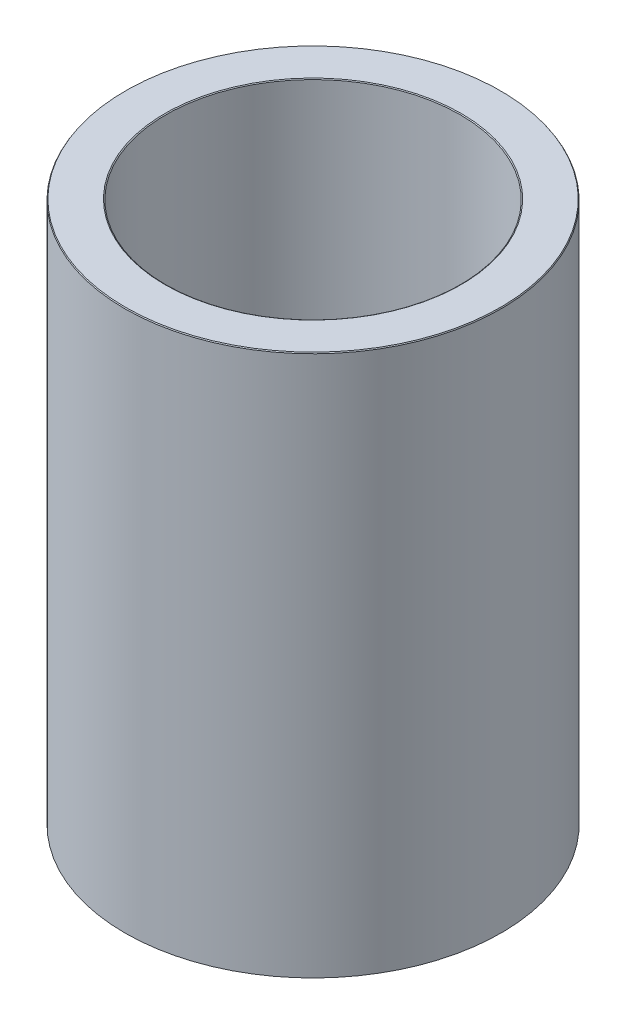
ISO-10303-21;
HEADER;
FILE_DESCRIPTION(('STEP AP214'),'2;1');
FILE_NAME('part.step','',(''),(''),'','','');
FILE_SCHEMA(('AUTOMOTIVE_DESIGN { 1 0 10303 214 1 1 1 1 }'));
ENDSEC;
DATA;
#1=APPLICATION_CONTEXT('core data for automotive mechanical design processes');
#2=APPLICATION_PROTOCOL_DEFINITION('international standard','automotive_design',2000,#1);
#3=PRODUCT_CONTEXT('',#1,'mechanical');
#4=PRODUCT('Part','Part','',(#3));
#5=PRODUCT_RELATED_PRODUCT_CATEGORY('part','',(#4));
#6=PRODUCT_DEFINITION_FORMATION('','',#4);
#7=PRODUCT_DEFINITION_CONTEXT('part definition',#1,'design');
#8=PRODUCT_DEFINITION('design','',#6,#7);
#9=PRODUCT_DEFINITION_SHAPE('','',#8);
#10=(LENGTH_UNIT() NAMED_UNIT(*) SI_UNIT(.MILLI.,.METRE.));
#11=(NAMED_UNIT(*) PLANE_ANGLE_UNIT() SI_UNIT($,.RADIAN.));
#12=(NAMED_UNIT(*) SI_UNIT($,.STERADIAN.) SOLID_ANGLE_UNIT());
#13=UNCERTAINTY_MEASURE_WITH_UNIT(LENGTH_MEASURE(1.E-05),#10,'distance_accuracy_value','');
#14=(GEOMETRIC_REPRESENTATION_CONTEXT(3) GLOBAL_UNCERTAINTY_ASSIGNED_CONTEXT((#13)) GLOBAL_UNIT_ASSIGNED_CONTEXT((#10,
#11,#12)) REPRESENTATION_CONTEXT('',''));
#15=CARTESIAN_POINT('',(0.,0.,0.));
#16=DIRECTION('',(0.,0.,1.));
#17=DIRECTION('',(1.,0.,0.));
#18=AXIS2_PLACEMENT_3D('',#15,#16,#17);
#19=CARTESIAN_POINT('',(0.,158.491382979003,0.));
#20=DIRECTION('',(0.,-1.,0.));
#21=DIRECTION('',(0.,0.,-1.));
#22=AXIS2_PLACEMENT_3D('',#19,#20,#21);
#23=CYLINDRICAL_SURFACE('',#22,55.);
#24=CARTESIAN_POINT('',(0.,0.184009060716139,0.));
#25=DIRECTION('',(0.,1.,0.));
#26=DIRECTION('',(0.,0.,1.));
#27=AXIS2_PLACEMENT_3D('',#24,#25,#26);
#28=CIRCLE('',#27,55.);
#29=CARTESIAN_POINT('',(0.,0.184009060716139,55.));
#30=VERTEX_POINT('',#29);
#31=EDGE_CURVE('E10',#30,#30,#28,.T.);
#32=ORIENTED_EDGE('',*,*,#31,.T.);
#33=EDGE_LOOP('',(#32));
#34=FACE_BOUND('',#33,.T.);
#35=CARTESIAN_POINT('',(0.,158.206325773304,0.));
#36=DIRECTION('',(0.,1.,0.));
#37=DIRECTION('',(0.,0.,1.));
#38=AXIS2_PLACEMENT_3D('',#35,#36,#37);
#39=CIRCLE('',#38,55.);
#40=CARTESIAN_POINT('',(0.,158.206325773304,55.));
#41=VERTEX_POINT('',#40);
#42=EDGE_CURVE('E50',#41,#41,#39,.F.);
#43=ORIENTED_EDGE('',*,*,#42,.T.);
#44=EDGE_LOOP('',(#43));
#45=FACE_BOUND('',#44,.T.);
#46=ADVANCED_FACE('F39',(#34,#45),#23,.T.);
#47=CARTESIAN_POINT('',(0.,158.491382979003,0.));
#48=DIRECTION('',(0.,1.,0.));
#49=DIRECTION('',(0.,0.,1.));
#50=AXIS2_PLACEMENT_3D('',#47,#48,#49);
#51=PLANE('',#50);
#52=CARTESIAN_POINT('',(0.,158.491382979003,0.));
#53=DIRECTION('',(0.,1.,0.));
#54=DIRECTION('',(0.,0.,1.));
#55=AXIS2_PLACEMENT_3D('',#52,#53,#54);
#56=CIRCLE('',#55,43.3261902332443);
#57=CARTESIAN_POINT('',(0.,158.491382979003,43.3261902332443));
#58=VERTEX_POINT('',#57);
#59=EDGE_CURVE('E58',#58,#58,#56,.F.);
#60=ORIENTED_EDGE('',*,*,#59,.T.);
#61=EDGE_LOOP('',(#60));
#62=FACE_BOUND('',#61,.T.);
#63=CARTESIAN_POINT('',(0.,158.491382979003,0.));
#64=DIRECTION('',(0.,1.,0.));
#65=DIRECTION('',(0.,0.,1.));
#66=AXIS2_PLACEMENT_3D('',#63,#64,#65);
#67=CIRCLE('',#66,54.8159909392839);
#68=CARTESIAN_POINT('',(0.,158.491382979003,54.8159909392839));
#69=VERTEX_POINT('',#68);
#70=EDGE_CURVE('E61',#69,#69,#67,.T.);
#71=ORIENTED_EDGE('',*,*,#70,.T.);
#72=EDGE_LOOP('',(#71));
#73=FACE_BOUND('',#72,.T.);
#74=ADVANCED_FACE('F88',(#62,#73),#51,.T.);
#75=CARTESIAN_POINT('',(0.,0.,0.));
#76=DIRECTION('',(0.,1.,0.));
#77=DIRECTION('',(0.,0.,1.));
#78=AXIS2_PLACEMENT_3D('',#75,#76,#77);
#79=PLANE('',#78);
#80=CARTESIAN_POINT('',(0.,0.,0.));
#81=DIRECTION('',(0.,1.,0.));
#82=DIRECTION('',(0.,0.,1.));
#83=AXIS2_PLACEMENT_3D('',#80,#81,#82);
#84=CIRCLE('',#83,43.2251420882615);
#85=CARTESIAN_POINT('',(0.,0.,-43.2251420882615));
#86=VERTEX_POINT('',#85);
#87=EDGE_CURVE('E51',#86,#86,#84,.T.);
#88=ORIENTED_EDGE('',*,*,#87,.T.);
#89=EDGE_LOOP('',(#88));
#90=FACE_BOUND('',#89,.T.);
#91=CARTESIAN_POINT('',(0.,0.,0.));
#92=DIRECTION('',(0.,1.,0.));
#93=DIRECTION('',(0.,0.,1.));
#94=AXIS2_PLACEMENT_3D('',#91,#92,#93);
#95=CIRCLE('',#94,54.7149427943011);
#96=CARTESIAN_POINT('',(0.,0.,54.7149427943011));
#97=VERTEX_POINT('',#96);
#98=EDGE_CURVE('E54',#97,#97,#95,.F.);
#99=ORIENTED_EDGE('',*,*,#98,.T.);
#100=EDGE_LOOP('',(#99));
#101=FACE_BOUND('',#100,.T.);
#102=ADVANCED_FACE('F83',(#90,#101),#79,.F.);
#103=CARTESIAN_POINT('',(0.,158.491382979003,0.));
#104=DIRECTION('',(0.,-1.,0.));
#105=DIRECTION('',(0.,0.,-1.));
#106=AXIS2_PLACEMENT_3D('',#103,#104,#105);
#107=CYLINDRICAL_SURFACE('',#106,43.0411330275453);
#108=CARTESIAN_POINT('',(0.,158.307373918287,0.));
#109=DIRECTION('',(0.,1.,0.));
#110=DIRECTION('',(0.,0.,1.));
#111=AXIS2_PLACEMENT_3D('',#108,#109,#110);
#112=CIRCLE('',#111,43.0411330275453);
#113=CARTESIAN_POINT('',(0.,158.307373918287,43.0411330275453));
#114=VERTEX_POINT('',#113);
#115=EDGE_CURVE('E67',#114,#114,#112,.T.);
#116=ORIENTED_EDGE('',*,*,#115,.T.);
#117=EDGE_LOOP('',(#116));
#118=FACE_BOUND('',#117,.T.);
#119=CARTESIAN_POINT('',(0.,0.285057205698935,0.));
#120=DIRECTION('',(0.,1.,0.));
#121=DIRECTION('',(0.,0.,1.));
#122=AXIS2_PLACEMENT_3D('',#119,#120,#121);
#123=CIRCLE('',#122,43.0411330275453);
#124=CARTESIAN_POINT('',(0.,0.285057205698935,-43.0411330275453));
#125=VERTEX_POINT('',#124);
#126=EDGE_CURVE('E69',#125,#125,#123,.F.);
#127=ORIENTED_EDGE('',*,*,#126,.T.);
#128=EDGE_LOOP('',(#127));
#129=FACE_BOUND('',#128,.T.);
#130=ADVANCED_FACE('F71',(#118,#129),#107,.F.);
#131=CARTESIAN_POINT('',(0.,158.307373918287,0.));
#132=DIRECTION('',(0.,1.,0.));
#133=DIRECTION('',(0.,0.,1.));
#134=AXIS2_PLACEMENT_3D('',#131,#132,#133);
#135=CONICAL_SURFACE('',#134,43.0411330275453,0.997579582361344);
#136=ORIENTED_EDGE('',*,*,#59,.F.);
#137=EDGE_LOOP('',(#136));
#138=FACE_BOUND('',#137,.T.);
#139=ORIENTED_EDGE('',*,*,#115,.F.);
#140=EDGE_LOOP('',(#139));
#141=FACE_BOUND('',#140,.T.);
#142=ADVANCED_FACE('F77',(#138,#141),#135,.F.);
#143=CARTESIAN_POINT('',(0.,0.,0.));
#144=DIRECTION('',(0.,-1.,0.));
#145=DIRECTION('',(0.,0.,-1.));
#146=AXIS2_PLACEMENT_3D('',#143,#144,#145);
#147=CONICAL_SURFACE('',#146,43.2251420882615,0.573216744433532);
#148=CARTESIAN_POINT('',(0.,0.285057205698935,-43.0411330275453));
#149=CARTESIAN_POINT('',(0.,0.282087859806238,-43.0430497885944));
#150=CARTESIAN_POINT('',(0.,0.279118513913541,-43.0449665496436));
#151=CARTESIAN_POINT('',(0.,0.273179822128146,-43.0488000717418));
#152=CARTESIAN_POINT('',(0.,0.270210476235449,-43.0507168327909));
#153=CARTESIAN_POINT('',(0.,0.264271784450054,-43.0545503548892));
#154=CARTESIAN_POINT('',(0.,0.261302438557357,-43.0564671159383));
#155=CARTESIAN_POINT('',(0.,0.255363746771962,-43.0603006380366));
#156=CARTESIAN_POINT('',(0.,0.252394400879266,-43.0622173990857));
#157=CARTESIAN_POINT('',(0.,0.246455709093872,-43.066050921184));
#158=CARTESIAN_POINT('',(0.,0.243486363201174,-43.0679676822331));
#159=CARTESIAN_POINT('',(0.,0.237547671415779,-43.0718012043313));
#160=CARTESIAN_POINT('',(0.,0.234578325523082,-43.0737179653805));
#161=CARTESIAN_POINT('',(0.,0.228639633737688,-43.0775514874787));
#162=CARTESIAN_POINT('',(0.,0.22567028784499,-43.0794682485278));
#163=CARTESIAN_POINT('',(0.,0.219731596059596,-43.0833017706261));
#164=CARTESIAN_POINT('',(0.,0.216762250166899,-43.0852185316752));
#165=CARTESIAN_POINT('',(0.,0.210823558381504,-43.0890520537735));
#166=CARTESIAN_POINT('',(0.,0.207854212488806,-43.0909688148226));
#167=CARTESIAN_POINT('',(0.,0.201915520703412,-43.0948023369209));
#168=CARTESIAN_POINT('',(0.,0.198946174810716,-43.09671909797));
#169=CARTESIAN_POINT('',(0.,0.193007483025321,-43.1005526200682));
#170=CARTESIAN_POINT('',(0.,0.190038137132624,-43.1024693811174));
#171=CARTESIAN_POINT('',(0.,0.184099445347229,-43.1063029032156));
#172=CARTESIAN_POINT('',(0.,0.181130099454532,-43.1082196642647));
#173=CARTESIAN_POINT('',(0.,0.175191407669137,-43.112053186363));
#174=CARTESIAN_POINT('',(0.,0.17222206177644,-43.1139699474121));
#175=CARTESIAN_POINT('',(0.,0.166283369991046,-43.1178034695104));
#176=CARTESIAN_POINT('',(0.,0.163314024098349,-43.1197202305595));
#177=CARTESIAN_POINT('',(0.,0.157375332312954,-43.1235537526577));
#178=CARTESIAN_POINT('',(0.,0.154405986420256,-43.1254705137069));
#179=CARTESIAN_POINT('',(0.,0.148467294634862,-43.1293040358051));
#180=CARTESIAN_POINT('',(0.,0.145497948742165,-43.1312207968543));
#181=CARTESIAN_POINT('',(0.,0.139559256956771,-43.1350543189525));
#182=CARTESIAN_POINT('',(0.,0.136589911064073,-43.1369710800017));
#183=CARTESIAN_POINT('',(0.,0.130651219278678,-43.1408046020999));
#184=CARTESIAN_POINT('',(0.,0.127681873385981,-43.142721363149));
#185=CARTESIAN_POINT('',(0.,0.121743181600587,-43.1465548852473));
#186=CARTESIAN_POINT('',(0.,0.11877383570789,-43.1484716462964));
#187=CARTESIAN_POINT('',(0.,0.112835143922495,-43.1523051683947));
#188=CARTESIAN_POINT('',(0.,0.109865798029798,-43.1542219294438));
#189=CARTESIAN_POINT('',(0.,0.103927106244404,-43.158055451542));
#190=CARTESIAN_POINT('',(0.,0.100957760351706,-43.1599722125912));
#191=CARTESIAN_POINT('',(0.,0.0950190685663116,-43.1638057346894));
#192=CARTESIAN_POINT('',(0.,0.0920497226736138,-43.1657224957385));
#193=CARTESIAN_POINT('',(0.,0.0861110308882197,-43.1695560178368));
#194=CARTESIAN_POINT('',(0.,0.0831416849955232,-43.1714727788859));
#195=CARTESIAN_POINT('',(0.,0.077202993210129,-43.1753063009842));
#196=CARTESIAN_POINT('',(0.,0.0742336473174312,-43.1772230620333));
#197=CARTESIAN_POINT('',(0.,0.0682949555320364,-43.1810565841316));
#198=CARTESIAN_POINT('',(0.,0.0653256096393393,-43.1829733451807));
#199=CARTESIAN_POINT('',(0.,0.0593869178539449,-43.1868068672789));
#200=CARTESIAN_POINT('',(0.,0.0564175719612476,-43.1887236283281));
#201=CARTESIAN_POINT('',(0.,0.0504788801758532,-43.1925571504263));
#202=CARTESIAN_POINT('',(0.,0.0475095342831561,-43.1944739114754));
#203=CARTESIAN_POINT('',(0.,0.0415708424977612,-43.1983074335737));
#204=CARTESIAN_POINT('',(0.,0.0386014966050635,-43.2002241946228));
#205=CARTESIAN_POINT('',(0.,0.0326628048196693,-43.2040577167211));
#206=CARTESIAN_POINT('',(0.,0.0296934589269728,-43.2059744777702));
#207=CARTESIAN_POINT('',(0.,0.0237547671415786,-43.2098079998685));
#208=CARTESIAN_POINT('',(0.,0.0207854212488809,-43.2117247609176));
#209=CARTESIAN_POINT('',(0.,0.014846729463486,-43.2155582830158));
#210=CARTESIAN_POINT('',(0.,0.0118773835707889,-43.217475044065));
#211=CARTESIAN_POINT('',(0.,0.00593869178539458,-43.2213085661632));
#212=CARTESIAN_POINT('',(0.,0.00296934589269744,-43.2232253272124));
#213=CARTESIAN_POINT('',(0.,0.,-43.2251420882615));
#214=B_SPLINE_CURVE_WITH_KNOTS('',3,(#148,#149,#150,#151,#152,#153,#154,#155,#156,#157,#158,
#159,#160,#161,#162,#163,#164,#165,#166,#167,#168,#169,#170,#171,#172,#173,#174,#175,#176,#177,
#178,#179,#180,#181,#182,#183,#184,#185,#186,#187,#188,#189,#190,#191,#192,#193,#194,#195,#196,
#197,#198,#199,#200,#201,#202,#203,#204,#205,#206,#207,#208,#209,#210,#211,#212,#213),
.UNSPECIFIED.,.F.,.F.,(4,2,2,2,2,2,2,2,2,2,2,2,2,2,2,2,2,2,2,2,2,2,2,2,2,2,2,2,2,2,2,2,4),(0.,
0.0106027775393685,0.021205555078737,0.0318083326181055,0.0424111101574777,0.0530138876968462,
0.0636166652362147,0.0742194427755832,0.0848222203149517,0.0954249978543202,0.106027775393692,
0.116630552933061,0.127233330472429,0.137836108011798,0.148438885551166,0.159041663090535,
0.169644440629907,0.180247218169276,0.190849995708644,0.201452773248013,0.212055550787381,
0.22265832832675,0.233261105866118,0.24386388340549,0.254466660944859,0.265069438484227,
0.275672216023596,0.286274993562964,0.296877771102333,0.307480548641705,0.318083326181073,
0.328686103720442,0.33928888125981),.UNSPECIFIED.);
#215=EDGE_CURVE('BSEAM73',#125,#86,#214,.T.);
#216=ORIENTED_EDGE('',*,*,#126,.F.);
#217=ORIENTED_EDGE('',*,*,#87,.F.);
#218=ORIENTED_EDGE('',*,*,#215,.T.);
#219=ORIENTED_EDGE('',*,*,#215,.F.);
#220=EDGE_LOOP('',(#216,#218,#217,#219));
#221=FACE_BOUND('',#220,.T.);
#222=ADVANCED_FACE('F73',(#221),#147,.F.);
#223=CARTESIAN_POINT('',(0.,0.184009060716139,0.));
#224=DIRECTION('',(0.,1.,0.));
#225=DIRECTION('',(0.,0.,1.));
#226=AXIS2_PLACEMENT_3D('',#223,#224,#225);
#227=CONICAL_SURFACE('',#226,55.,0.997579582361372);
#228=ORIENTED_EDGE('',*,*,#98,.F.);
#229=EDGE_LOOP('',(#228));
#230=FACE_BOUND('',#229,.T.);
#231=ORIENTED_EDGE('',*,*,#31,.F.);
#232=EDGE_LOOP('',(#231));
#233=FACE_BOUND('',#232,.T.);
#234=ADVANCED_FACE('F76',(#230,#233),#227,.T.);
#235=CARTESIAN_POINT('',(0.,158.491382979003,0.));
#236=DIRECTION('',(0.,-1.,0.));
#237=DIRECTION('',(0.,0.,-1.));
#238=AXIS2_PLACEMENT_3D('',#235,#236,#237);
#239=CONICAL_SURFACE('',#238,54.8159909392839,0.573216744433553);
#240=ORIENTED_EDGE('',*,*,#42,.F.);
#241=EDGE_LOOP('',(#240));
#242=FACE_BOUND('',#241,.T.);
#243=ORIENTED_EDGE('',*,*,#70,.F.);
#244=EDGE_LOOP('',(#243));
#245=FACE_BOUND('',#244,.T.);
#246=ADVANCED_FACE('F45',(#242,#245),#239,.T.);
#247=CLOSED_SHELL('',(#46,#74,#102,#130,#142,#222,#234,#246));
#248=MANIFOLD_SOLID_BREP('B2',#247);
#249=ADVANCED_BREP_SHAPE_REPRESENTATION('',(#18,#248),#14);
#250=SHAPE_DEFINITION_REPRESENTATION(#9,#249);
ENDSEC;
END-ISO-10303-21;
